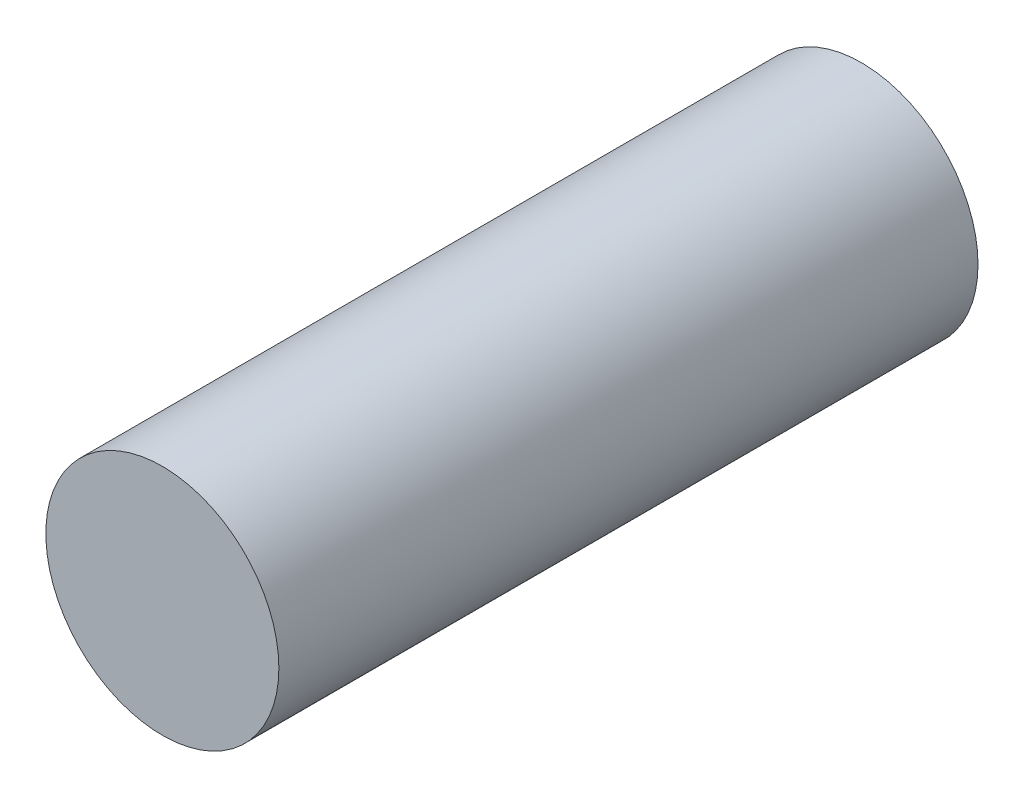
ISO-10303-21;
HEADER;
FILE_DESCRIPTION(('STEP AP214'),'2;1');
FILE_NAME('part.step','',(''),(''),'','','');
FILE_SCHEMA(('AUTOMOTIVE_DESIGN { 1 0 10303 214 1 1 1 1 }'));
ENDSEC;
DATA;
#1=APPLICATION_CONTEXT('core data for automotive mechanical design processes');
#2=APPLICATION_PROTOCOL_DEFINITION('international standard','automotive_design',2000,#1);
#3=PRODUCT_CONTEXT('',#1,'mechanical');
#4=PRODUCT('Part','Part','',(#3));
#5=PRODUCT_RELATED_PRODUCT_CATEGORY('part','',(#4));
#6=PRODUCT_DEFINITION_FORMATION('','',#4);
#7=PRODUCT_DEFINITION_CONTEXT('part definition',#1,'design');
#8=PRODUCT_DEFINITION('design','',#6,#7);
#9=PRODUCT_DEFINITION_SHAPE('','',#8);
#10=(LENGTH_UNIT() NAMED_UNIT(*) SI_UNIT(.MILLI.,.METRE.));
#11=(NAMED_UNIT(*) PLANE_ANGLE_UNIT() SI_UNIT($,.RADIAN.));
#12=(NAMED_UNIT(*) SI_UNIT($,.STERADIAN.) SOLID_ANGLE_UNIT());
#13=UNCERTAINTY_MEASURE_WITH_UNIT(LENGTH_MEASURE(1.E-05),#10,'distance_accuracy_value','');
#14=(GEOMETRIC_REPRESENTATION_CONTEXT(3) GLOBAL_UNCERTAINTY_ASSIGNED_CONTEXT((#13)) GLOBAL_UNIT_ASSIGNED_CONTEXT((#10,
#11,#12)) REPRESENTATION_CONTEXT('',''));
#15=CARTESIAN_POINT('',(0.,0.,0.));
#16=DIRECTION('',(0.,0.,1.));
#17=DIRECTION('',(1.,0.,0.));
#18=AXIS2_PLACEMENT_3D('',#15,#16,#17);
#19=CARTESIAN_POINT('',(0.,0.,30.));
#20=DIRECTION('',(0.,0.,-1.));
#21=DIRECTION('',(-1.,0.,0.));
#22=AXIS2_PLACEMENT_3D('',#19,#20,#21);
#23=CYLINDRICAL_SURFACE('',#22,5.);
#24=CARTESIAN_POINT('',(0.,0.,30.));
#25=DIRECTION('',(0.,0.,1.));
#26=DIRECTION('',(1.,0.,0.));
#27=AXIS2_PLACEMENT_3D('',#24,#25,#26);
#28=CIRCLE('',#27,5.);
#29=CARTESIAN_POINT('',(5.,0.,30.));
#30=VERTEX_POINT('',#29);
#31=EDGE_CURVE('E10',#30,#30,#28,.T.);
#32=ORIENTED_EDGE('',*,*,#31,.F.);
#33=EDGE_LOOP('',(#32));
#34=FACE_BOUND('',#33,.T.);
#35=CARTESIAN_POINT('',(0.,0.,0.));
#36=DIRECTION('',(0.,0.,1.));
#37=DIRECTION('',(1.,0.,0.));
#38=AXIS2_PLACEMENT_3D('',#35,#36,#37);
#39=CIRCLE('',#38,5.);
#40=CARTESIAN_POINT('',(5.,0.,0.));
#41=VERTEX_POINT('',#40);
#42=EDGE_CURVE('E40',#41,#41,#39,.T.);
#43=ORIENTED_EDGE('',*,*,#42,.T.);
#44=EDGE_LOOP('',(#43));
#45=FACE_BOUND('',#44,.T.);
#46=ADVANCED_FACE('F37',(#34,#45),#23,.T.);
#47=CARTESIAN_POINT('',(0.,0.,30.));
#48=DIRECTION('',(0.,0.,1.));
#49=DIRECTION('',(1.,0.,0.));
#50=AXIS2_PLACEMENT_3D('',#47,#48,#49);
#51=PLANE('',#50);
#52=ORIENTED_EDGE('',*,*,#31,.T.);
#53=EDGE_LOOP('',(#52));
#54=FACE_BOUND('',#53,.T.);
#55=ADVANCED_FACE('F54',(#54),#51,.T.);
#56=CARTESIAN_POINT('',(0.,0.,0.));
#57=DIRECTION('',(0.,0.,1.));
#58=DIRECTION('',(1.,0.,0.));
#59=AXIS2_PLACEMENT_3D('',#56,#57,#58);
#60=PLANE('',#59);
#61=ORIENTED_EDGE('',*,*,#42,.F.);
#62=EDGE_LOOP('',(#61));
#63=FACE_BOUND('',#62,.T.);
#64=ADVANCED_FACE('F52',(#63),#60,.F.);
#65=CLOSED_SHELL('',(#46,#55,#64));
#66=MANIFOLD_SOLID_BREP('B2',#65);
#67=ADVANCED_BREP_SHAPE_REPRESENTATION('',(#18,#66),#14);
#68=SHAPE_DEFINITION_REPRESENTATION(#9,#67);
ENDSEC;
END-ISO-10303-21;
